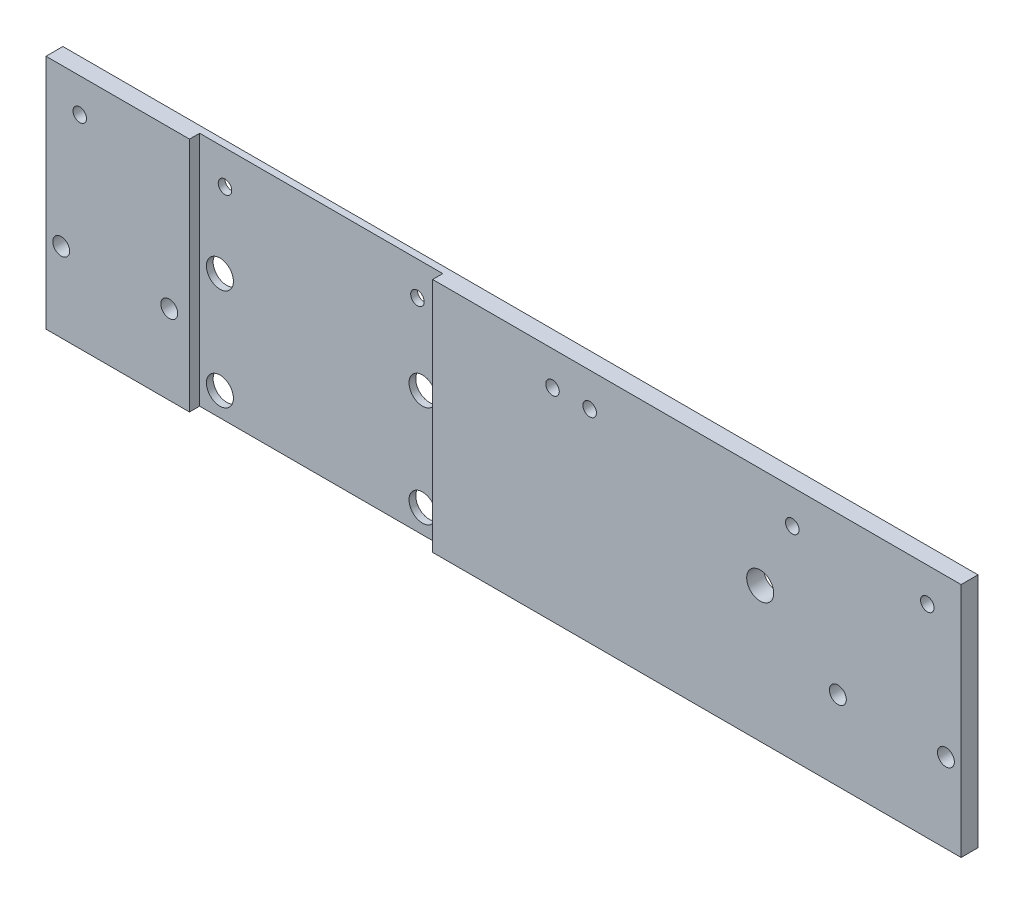
ISO-10303-21;
HEADER;
FILE_DESCRIPTION(('STEP AP214'),'2;1');
FILE_NAME('part.step','',(''),(''),'','','');
FILE_SCHEMA(('AUTOMOTIVE_DESIGN { 1 0 10303 214 1 1 1 1 }'));
ENDSEC;
DATA;
#1=APPLICATION_CONTEXT('core data for automotive mechanical design processes');
#2=APPLICATION_PROTOCOL_DEFINITION('international standard','automotive_design',2000,#1);
#3=PRODUCT_CONTEXT('',#1,'mechanical');
#4=PRODUCT('Part','Part','',(#3));
#5=PRODUCT_RELATED_PRODUCT_CATEGORY('part','',(#4));
#6=PRODUCT_DEFINITION_FORMATION('','',#4);
#7=PRODUCT_DEFINITION_CONTEXT('part definition',#1,'design');
#8=PRODUCT_DEFINITION('design','',#6,#7);
#9=PRODUCT_DEFINITION_SHAPE('','',#8);
#10=(LENGTH_UNIT() NAMED_UNIT(*) SI_UNIT(.MILLI.,.METRE.));
#11=(NAMED_UNIT(*) PLANE_ANGLE_UNIT() SI_UNIT($,.RADIAN.));
#12=(NAMED_UNIT(*) SI_UNIT($,.STERADIAN.) SOLID_ANGLE_UNIT());
#13=UNCERTAINTY_MEASURE_WITH_UNIT(LENGTH_MEASURE(1.E-05),#10,'distance_accuracy_value','');
#14=(GEOMETRIC_REPRESENTATION_CONTEXT(3) GLOBAL_UNCERTAINTY_ASSIGNED_CONTEXT((#13)) GLOBAL_UNIT_ASSIGNED_CONTEXT((#10,
#11,#12)) REPRESENTATION_CONTEXT('',''));
#15=CARTESIAN_POINT('',(0.,0.,0.));
#16=DIRECTION('',(0.,0.,1.));
#17=DIRECTION('',(1.,0.,0.));
#18=AXIS2_PLACEMENT_3D('',#15,#16,#17);
#19=CARTESIAN_POINT('',(0.,0.,5.));
#20=DIRECTION('',(0.,0.,-1.));
#21=DIRECTION('',(-1.,0.,0.));
#22=AXIS2_PLACEMENT_3D('',#19,#20,#21);
#23=PLANE('',#22);
#24=CARTESIAN_POINT('',(10.,60.,5.));
#25=DIRECTION('',(0.,0.,-1.));
#26=DIRECTION('',(-1.,0.,0.));
#27=AXIS2_PLACEMENT_3D('',#24,#25,#26);
#28=CIRCLE('',#27,2.);
#29=CARTESIAN_POINT('',(8.00000000000001,60.,5.));
#30=VERTEX_POINT('',#29);
#31=EDGE_CURVE('E188',#30,#30,#28,.T.);
#32=ORIENTED_EDGE('',*,*,#31,.T.);
#33=EDGE_LOOP('',(#32));
#34=FACE_BOUND('',#33,.T.);
#35=CARTESIAN_POINT('',(4.5,23.5,5.));
#36=DIRECTION('',(0.,0.,-1.));
#37=DIRECTION('',(-1.,0.,0.));
#38=AXIS2_PLACEMENT_3D('',#35,#36,#37);
#39=CIRCLE('',#38,2.5);
#40=CARTESIAN_POINT('',(2.,23.5,5.));
#41=VERTEX_POINT('',#40);
#42=EDGE_CURVE('E205',#41,#41,#39,.T.);
#43=ORIENTED_EDGE('',*,*,#42,.T.);
#44=EDGE_LOOP('',(#43));
#45=FACE_BOUND('',#44,.T.);
#46=CARTESIAN_POINT('',(36.5,23.5,5.));
#47=DIRECTION('',(0.,0.,-1.));
#48=DIRECTION('',(-1.,0.,0.));
#49=AXIS2_PLACEMENT_3D('',#46,#47,#48);
#50=CIRCLE('',#49,2.5);
#51=CARTESIAN_POINT('',(34.,23.5,5.));
#52=VERTEX_POINT('',#51);
#53=EDGE_CURVE('E211',#52,#52,#50,.T.);
#54=ORIENTED_EDGE('',*,*,#53,.T.);
#55=EDGE_LOOP('',(#54));
#56=FACE_BOUND('',#55,.T.);
#57=DIRECTION('',(1.,0.,0.));
#58=VECTOR('',#57,1.);
#59=CARTESIAN_POINT('',(0.,0.,5.));
#60=LINE('',#59,#58);
#61=CARTESIAN_POINT('',(0.,0.,5.));
#62=VERTEX_POINT('',#61);
#63=CARTESIAN_POINT('',(42.5,0.,5.));
#64=VERTEX_POINT('',#63);
#65=EDGE_CURVE('E88',#62,#64,#60,.T.);
#66=ORIENTED_EDGE('',*,*,#65,.T.);
#67=DIRECTION('',(0.,-1.,0.));
#68=VECTOR('',#67,1.);
#69=CARTESIAN_POINT('',(42.5,70.,5.));
#70=LINE('',#69,#68);
#71=CARTESIAN_POINT('',(42.5,70.,5.));
#72=VERTEX_POINT('',#71);
#73=EDGE_CURVE('E114',#72,#64,#70,.T.);
#74=ORIENTED_EDGE('',*,*,#73,.F.);
#75=DIRECTION('',(-1.,0.,0.));
#76=VECTOR('',#75,1.);
#77=CARTESIAN_POINT('',(0.,70.,5.));
#78=LINE('',#77,#76);
#79=CARTESIAN_POINT('',(0.,70.,5.));
#80=VERTEX_POINT('',#79);
#81=EDGE_CURVE('E59',#72,#80,#78,.T.);
#82=ORIENTED_EDGE('',*,*,#81,.T.);
#83=DIRECTION('',(0.,-1.,0.));
#84=VECTOR('',#83,1.);
#85=CARTESIAN_POINT('',(0.,0.,5.));
#86=LINE('',#85,#84);
#87=EDGE_CURVE('E145',#80,#62,#86,.T.);
#88=ORIENTED_EDGE('',*,*,#87,.T.);
#89=EDGE_LOOP('',(#66,#74,#82,#88));
#90=FACE_BOUND('',#89,.T.);
#91=ADVANCED_FACE('F33',(#34,#45,#56,#90),#23,.F.);
#92=CARTESIAN_POINT('',(0.,0.,5.));
#93=DIRECTION('',(1.,0.,0.));
#94=DIRECTION('',(0.,0.,-1.));
#95=AXIS2_PLACEMENT_3D('',#92,#93,#94);
#96=PLANE('',#95);
#97=DIRECTION('',(0.,-1.,0.));
#98=VECTOR('',#97,1.);
#99=CARTESIAN_POINT('',(0.,0.,0.));
#100=LINE('',#99,#98);
#101=CARTESIAN_POINT('',(0.,70.,0.));
#102=VERTEX_POINT('',#101);
#103=CARTESIAN_POINT('',(0.,0.,0.));
#104=VERTEX_POINT('',#103);
#105=EDGE_CURVE('E140',#102,#104,#100,.T.);
#106=ORIENTED_EDGE('',*,*,#105,.T.);
#107=DIRECTION('',(0.,0.,-1.));
#108=VECTOR('',#107,1.);
#109=CARTESIAN_POINT('',(0.,0.,5.));
#110=LINE('',#109,#108);
#111=EDGE_CURVE('E11',#62,#104,#110,.T.);
#112=ORIENTED_EDGE('',*,*,#111,.F.);
#113=ORIENTED_EDGE('',*,*,#87,.F.);
#114=DIRECTION('',(0.,0.,-1.));
#115=VECTOR('',#114,1.);
#116=CARTESIAN_POINT('',(0.,70.,5.));
#117=LINE('',#116,#115);
#118=EDGE_CURVE('E154',#80,#102,#117,.T.);
#119=ORIENTED_EDGE('',*,*,#118,.T.);
#120=EDGE_LOOP('',(#106,#112,#113,#119));
#121=FACE_BOUND('',#120,.T.);
#122=ADVANCED_FACE('F35',(#121),#96,.F.);
#123=CARTESIAN_POINT('',(0.,0.,5.));
#124=DIRECTION('',(0.,1.,0.));
#125=DIRECTION('',(0.,0.,1.));
#126=AXIS2_PLACEMENT_3D('',#123,#124,#125);
#127=PLANE('',#126);
#128=DIRECTION('',(1.,0.,0.));
#129=VECTOR('',#128,1.);
#130=CARTESIAN_POINT('',(42.5,0.,2.));
#131=LINE('',#130,#129);
#132=CARTESIAN_POINT('',(42.5,0.,2.));
#133=VERTEX_POINT('',#132);
#134=CARTESIAN_POINT('',(114.5,0.,2.));
#135=VERTEX_POINT('',#134);
#136=EDGE_CURVE('E122',#133,#135,#131,.T.);
#137=ORIENTED_EDGE('',*,*,#136,.F.);
#138=DIRECTION('',(0.,0.,1.));
#139=VECTOR('',#138,1.);
#140=CARTESIAN_POINT('',(42.5,0.,2.));
#141=LINE('',#140,#139);
#142=EDGE_CURVE('E109',#133,#64,#141,.T.);
#143=ORIENTED_EDGE('',*,*,#142,.T.);
#144=ORIENTED_EDGE('',*,*,#65,.F.);
#145=ORIENTED_EDGE('',*,*,#111,.T.);
#146=DIRECTION('',(1.,0.,0.));
#147=VECTOR('',#146,1.);
#148=CARTESIAN_POINT('',(0.,0.,0.));
#149=LINE('',#148,#147);
#150=CARTESIAN_POINT('',(271.,0.,0.));
#151=VERTEX_POINT('',#150);
#152=EDGE_CURVE('E157',#104,#151,#149,.T.);
#153=ORIENTED_EDGE('',*,*,#152,.T.);
#154=DIRECTION('',(0.,0.,-1.));
#155=VECTOR('',#154,1.);
#156=CARTESIAN_POINT('',(271.,0.,5.));
#157=LINE('',#156,#155);
#158=CARTESIAN_POINT('',(271.,0.,5.));
#159=VERTEX_POINT('',#158);
#160=EDGE_CURVE('E42',#159,#151,#157,.T.);
#161=ORIENTED_EDGE('',*,*,#160,.F.);
#162=CARTESIAN_POINT('',(114.5,0.,5.));
#163=VERTEX_POINT('',#162);
#164=EDGE_CURVE('E147',#163,#159,#60,.T.);
#165=ORIENTED_EDGE('',*,*,#164,.F.);
#166=DIRECTION('',(0.,0.,1.));
#167=VECTOR('',#166,1.);
#168=CARTESIAN_POINT('',(114.5,0.,2.));
#169=LINE('',#168,#167);
#170=EDGE_CURVE('E50',#135,#163,#169,.T.);
#171=ORIENTED_EDGE('',*,*,#170,.F.);
#172=EDGE_LOOP('',(#137,#143,#144,#145,#153,#161,#165,#171));
#173=FACE_BOUND('',#172,.T.);
#174=ADVANCED_FACE('F127',(#173),#127,.F.);
#175=CARTESIAN_POINT('',(271.,0.,5.));
#176=DIRECTION('',(-1.,0.,0.));
#177=DIRECTION('',(0.,0.,1.));
#178=AXIS2_PLACEMENT_3D('',#175,#176,#177);
#179=PLANE('',#178);
#180=DIRECTION('',(0.,1.,0.));
#181=VECTOR('',#180,1.);
#182=CARTESIAN_POINT('',(271.,0.,0.));
#183=LINE('',#182,#181);
#184=CARTESIAN_POINT('',(271.,70.,0.));
#185=VERTEX_POINT('',#184);
#186=EDGE_CURVE('E159',#151,#185,#183,.T.);
#187=ORIENTED_EDGE('',*,*,#186,.T.);
#188=DIRECTION('',(0.,0.,-1.));
#189=VECTOR('',#188,1.);
#190=CARTESIAN_POINT('',(271.,70.,5.));
#191=LINE('',#190,#189);
#192=CARTESIAN_POINT('',(271.,70.,5.));
#193=VERTEX_POINT('',#192);
#194=EDGE_CURVE('E163',#193,#185,#191,.T.);
#195=ORIENTED_EDGE('',*,*,#194,.F.);
#196=DIRECTION('',(0.,1.,0.));
#197=VECTOR('',#196,1.);
#198=CARTESIAN_POINT('',(271.,0.,5.));
#199=LINE('',#198,#197);
#200=EDGE_CURVE('E149',#159,#193,#199,.T.);
#201=ORIENTED_EDGE('',*,*,#200,.F.);
#202=ORIENTED_EDGE('',*,*,#160,.T.);
#203=EDGE_LOOP('',(#187,#195,#201,#202));
#204=FACE_BOUND('',#203,.T.);
#205=ADVANCED_FACE('F261',(#204),#179,.F.);
#206=CARTESIAN_POINT('',(0.,70.,5.));
#207=DIRECTION('',(0.,-1.,0.));
#208=DIRECTION('',(0.,0.,-1.));
#209=AXIS2_PLACEMENT_3D('',#206,#207,#208);
#210=PLANE('',#209);
#211=ORIENTED_EDGE('',*,*,#81,.F.);
#212=DIRECTION('',(0.,0.,1.));
#213=VECTOR('',#212,1.);
#214=CARTESIAN_POINT('',(42.5,70.,2.));
#215=LINE('',#214,#213);
#216=CARTESIAN_POINT('',(42.5,70.,2.));
#217=VERTEX_POINT('',#216);
#218=EDGE_CURVE('E138',#217,#72,#215,.T.);
#219=ORIENTED_EDGE('',*,*,#218,.F.);
#220=DIRECTION('',(-1.,0.,0.));
#221=VECTOR('',#220,1.);
#222=CARTESIAN_POINT('',(42.5,70.,2.));
#223=LINE('',#222,#221);
#224=CARTESIAN_POINT('',(114.5,70.,2.));
#225=VERTEX_POINT('',#224);
#226=EDGE_CURVE('E116',#225,#217,#223,.T.);
#227=ORIENTED_EDGE('',*,*,#226,.F.);
#228=DIRECTION('',(0.,0.,1.));
#229=VECTOR('',#228,1.);
#230=CARTESIAN_POINT('',(114.5,70.,2.));
#231=LINE('',#230,#229);
#232=CARTESIAN_POINT('',(114.5,70.,5.));
#233=VERTEX_POINT('',#232);
#234=EDGE_CURVE('E141',#225,#233,#231,.T.);
#235=ORIENTED_EDGE('',*,*,#234,.T.);
#236=EDGE_CURVE('E151',#193,#233,#78,.T.);
#237=ORIENTED_EDGE('',*,*,#236,.F.);
#238=ORIENTED_EDGE('',*,*,#194,.T.);
#239=DIRECTION('',(-1.,0.,0.));
#240=VECTOR('',#239,1.);
#241=CARTESIAN_POINT('',(0.,70.,0.));
#242=LINE('',#241,#240);
#243=EDGE_CURVE('E81',#185,#102,#242,.T.);
#244=ORIENTED_EDGE('',*,*,#243,.T.);
#245=ORIENTED_EDGE('',*,*,#118,.F.);
#246=EDGE_LOOP('',(#211,#219,#227,#235,#237,#238,#244,#245));
#247=FACE_BOUND('',#246,.T.);
#248=ADVANCED_FACE('F247',(#247),#210,.F.);
#249=CARTESIAN_POINT('',(150.,60.,5.));
#250=DIRECTION('',(0.,0.,-1.));
#251=DIRECTION('',(-1.,0.,0.));
#252=AXIS2_PLACEMENT_3D('',#249,#250,#251);
#253=CIRCLE('',#252,2.);
#254=CARTESIAN_POINT('',(148.,60.,5.));
#255=VERTEX_POINT('',#254);
#256=EDGE_CURVE('E266',#255,#255,#253,.T.);
#257=ORIENTED_EDGE('',*,*,#256,.T.);
#258=EDGE_LOOP('',(#257));
#259=FACE_BOUND('',#258,.T.);
#260=CARTESIAN_POINT('',(211.5,40.,5.));
#261=DIRECTION('',(0.,0.,-1.));
#262=DIRECTION('',(-1.,0.,0.));
#263=AXIS2_PLACEMENT_3D('',#260,#261,#262);
#264=CIRCLE('',#263,3.99999999999999);
#265=CARTESIAN_POINT('',(207.5,40.,5.));
#266=VERTEX_POINT('',#265);
#267=EDGE_CURVE('E270',#266,#266,#264,.T.);
#268=ORIENTED_EDGE('',*,*,#267,.T.);
#269=EDGE_LOOP('',(#268));
#270=FACE_BOUND('',#269,.T.);
#271=CARTESIAN_POINT('',(261.,60.,5.));
#272=DIRECTION('',(0.,0.,-1.));
#273=DIRECTION('',(-1.,0.,0.));
#274=AXIS2_PLACEMENT_3D('',#271,#272,#273);
#275=CIRCLE('',#274,2.);
#276=CARTESIAN_POINT('',(259.,60.,5.));
#277=VERTEX_POINT('',#276);
#278=EDGE_CURVE('E274',#277,#277,#275,.T.);
#279=ORIENTED_EDGE('',*,*,#278,.T.);
#280=EDGE_LOOP('',(#279));
#281=FACE_BOUND('',#280,.T.);
#282=CARTESIAN_POINT('',(221.,60.,5.));
#283=DIRECTION('',(0.,0.,-1.));
#284=DIRECTION('',(-1.,0.,0.));
#285=AXIS2_PLACEMENT_3D('',#282,#283,#284);
#286=CIRCLE('',#285,2.);
#287=CARTESIAN_POINT('',(219.,60.,5.));
#288=VERTEX_POINT('',#287);
#289=EDGE_CURVE('E278',#288,#288,#286,.T.);
#290=ORIENTED_EDGE('',*,*,#289,.T.);
#291=EDGE_LOOP('',(#290));
#292=FACE_BOUND('',#291,.T.);
#293=CARTESIAN_POINT('',(161.,60.,5.));
#294=DIRECTION('',(0.,0.,-1.));
#295=DIRECTION('',(-1.,0.,0.));
#296=AXIS2_PLACEMENT_3D('',#293,#294,#295);
#297=CIRCLE('',#296,2.);
#298=CARTESIAN_POINT('',(159.,60.,5.));
#299=VERTEX_POINT('',#298);
#300=EDGE_CURVE('E191',#299,#299,#297,.T.);
#301=ORIENTED_EDGE('',*,*,#300,.T.);
#302=EDGE_LOOP('',(#301));
#303=FACE_BOUND('',#302,.T.);
#304=CARTESIAN_POINT('',(266.5,23.5,5.));
#305=DIRECTION('',(0.,0.,-1.));
#306=DIRECTION('',(-1.,0.,0.));
#307=AXIS2_PLACEMENT_3D('',#304,#305,#306);
#308=CIRCLE('',#307,2.50000000000002);
#309=CARTESIAN_POINT('',(264.,23.5,5.));
#310=VERTEX_POINT('',#309);
#311=EDGE_CURVE('E217',#310,#310,#308,.T.);
#312=ORIENTED_EDGE('',*,*,#311,.T.);
#313=EDGE_LOOP('',(#312));
#314=FACE_BOUND('',#313,.T.);
#315=CARTESIAN_POINT('',(234.5,23.5,5.));
#316=DIRECTION('',(0.,0.,-1.));
#317=DIRECTION('',(-1.,0.,0.));
#318=AXIS2_PLACEMENT_3D('',#315,#316,#317);
#319=CIRCLE('',#318,2.5);
#320=CARTESIAN_POINT('',(232.,23.5,5.));
#321=VERTEX_POINT('',#320);
#322=EDGE_CURVE('E223',#321,#321,#319,.T.);
#323=ORIENTED_EDGE('',*,*,#322,.T.);
#324=EDGE_LOOP('',(#323));
#325=FACE_BOUND('',#324,.T.);
#326=ORIENTED_EDGE('',*,*,#236,.T.);
#327=DIRECTION('',(0.,1.,0.));
#328=VECTOR('',#327,1.);
#329=CARTESIAN_POINT('',(114.5,70.,5.));
#330=LINE('',#329,#328);
#331=EDGE_CURVE('E125',#163,#233,#330,.T.);
#332=ORIENTED_EDGE('',*,*,#331,.F.);
#333=ORIENTED_EDGE('',*,*,#164,.T.);
#334=ORIENTED_EDGE('',*,*,#200,.T.);
#335=EDGE_LOOP('',(#326,#332,#333,#334));
#336=FACE_BOUND('',#335,.T.);
#337=ADVANCED_FACE('F239',(#259,#270,#281,#292,#303,#314,#325,#336),#23,.F.);
#338=CARTESIAN_POINT('',(0.,0.,0.));
#339=DIRECTION('',(0.,0.,-1.));
#340=DIRECTION('',(-1.,0.,0.));
#341=AXIS2_PLACEMENT_3D('',#338,#339,#340);
#342=PLANE('',#341);
#343=CARTESIAN_POINT('',(150.,60.,0.));
#344=DIRECTION('',(0.,0.,-1.));
#345=DIRECTION('',(-1.,0.,0.));
#346=AXIS2_PLACEMENT_3D('',#343,#344,#345);
#347=CIRCLE('',#346,2.);
#348=CARTESIAN_POINT('',(148.,60.,0.));
#349=VERTEX_POINT('',#348);
#350=EDGE_CURVE('E364',#349,#349,#347,.T.);
#351=ORIENTED_EDGE('',*,*,#350,.F.);
#352=EDGE_LOOP('',(#351));
#353=FACE_BOUND('',#352,.T.);
#354=CARTESIAN_POINT('',(211.5,40.,0.));
#355=DIRECTION('',(0.,0.,-1.));
#356=DIRECTION('',(-1.,0.,0.));
#357=AXIS2_PLACEMENT_3D('',#354,#355,#356);
#358=CIRCLE('',#357,3.99999999999999);
#359=CARTESIAN_POINT('',(207.5,40.,0.));
#360=VERTEX_POINT('',#359);
#361=EDGE_CURVE('E365',#360,#360,#358,.T.);
#362=ORIENTED_EDGE('',*,*,#361,.F.);
#363=EDGE_LOOP('',(#362));
#364=FACE_BOUND('',#363,.T.);
#365=CARTESIAN_POINT('',(107.,60.,0.));
#366=DIRECTION('',(0.,0.,-1.));
#367=DIRECTION('',(-1.,0.,0.));
#368=AXIS2_PLACEMENT_3D('',#365,#366,#367);
#369=CIRCLE('',#368,2.);
#370=CARTESIAN_POINT('',(105.,60.,0.));
#371=VERTEX_POINT('',#370);
#372=EDGE_CURVE('E372',#371,#371,#369,.T.);
#373=ORIENTED_EDGE('',*,*,#372,.F.);
#374=EDGE_LOOP('',(#373));
#375=FACE_BOUND('',#374,.T.);
#376=CARTESIAN_POINT('',(261.,60.,0.));
#377=DIRECTION('',(0.,0.,-1.));
#378=DIRECTION('',(-1.,0.,0.));
#379=AXIS2_PLACEMENT_3D('',#376,#377,#378);
#380=CIRCLE('',#379,2.);
#381=CARTESIAN_POINT('',(259.,60.,0.));
#382=VERTEX_POINT('',#381);
#383=EDGE_CURVE('E375',#382,#382,#380,.T.);
#384=ORIENTED_EDGE('',*,*,#383,.F.);
#385=EDGE_LOOP('',(#384));
#386=FACE_BOUND('',#385,.T.);
#387=CARTESIAN_POINT('',(221.,60.,0.));
#388=DIRECTION('',(0.,0.,-1.));
#389=DIRECTION('',(-1.,0.,0.));
#390=AXIS2_PLACEMENT_3D('',#387,#388,#389);
#391=CIRCLE('',#390,2.);
#392=CARTESIAN_POINT('',(219.,60.,0.));
#393=VERTEX_POINT('',#392);
#394=EDGE_CURVE('E379',#393,#393,#391,.T.);
#395=ORIENTED_EDGE('',*,*,#394,.F.);
#396=EDGE_LOOP('',(#395));
#397=FACE_BOUND('',#396,.T.);
#398=CARTESIAN_POINT('',(161.,60.,0.));
#399=DIRECTION('',(0.,0.,-1.));
#400=DIRECTION('',(-1.,0.,0.));
#401=AXIS2_PLACEMENT_3D('',#398,#399,#400);
#402=CIRCLE('',#401,2.);
#403=CARTESIAN_POINT('',(159.,60.,0.));
#404=VERTEX_POINT('',#403);
#405=EDGE_CURVE('E196',#404,#404,#402,.T.);
#406=ORIENTED_EDGE('',*,*,#405,.F.);
#407=EDGE_LOOP('',(#406));
#408=FACE_BOUND('',#407,.T.);
#409=CARTESIAN_POINT('',(50.,60.,0.));
#410=DIRECTION('',(0.,0.,-1.));
#411=DIRECTION('',(-1.,0.,0.));
#412=AXIS2_PLACEMENT_3D('',#409,#410,#411);
#413=CIRCLE('',#412,2.);
#414=CARTESIAN_POINT('',(48.,60.,0.));
#415=VERTEX_POINT('',#414);
#416=EDGE_CURVE('E184',#415,#415,#413,.T.);
#417=ORIENTED_EDGE('',*,*,#416,.F.);
#418=EDGE_LOOP('',(#417));
#419=FACE_BOUND('',#418,.T.);
#420=CARTESIAN_POINT('',(10.,60.,0.));
#421=DIRECTION('',(0.,0.,-1.));
#422=DIRECTION('',(-1.,0.,0.));
#423=AXIS2_PLACEMENT_3D('',#420,#421,#422);
#424=CIRCLE('',#423,2.);
#425=CARTESIAN_POINT('',(8.00000000000001,60.,0.));
#426=VERTEX_POINT('',#425);
#427=EDGE_CURVE('E183',#426,#426,#424,.T.);
#428=ORIENTED_EDGE('',*,*,#427,.F.);
#429=EDGE_LOOP('',(#428));
#430=FACE_BOUND('',#429,.T.);
#431=CARTESIAN_POINT('',(4.5,23.5,0.));
#432=DIRECTION('',(0.,0.,-1.));
#433=DIRECTION('',(-1.,0.,0.));
#434=AXIS2_PLACEMENT_3D('',#431,#432,#433);
#435=CIRCLE('',#434,2.5);
#436=CARTESIAN_POINT('',(2.,23.5,0.));
#437=VERTEX_POINT('',#436);
#438=EDGE_CURVE('E202',#437,#437,#435,.T.);
#439=ORIENTED_EDGE('',*,*,#438,.F.);
#440=EDGE_LOOP('',(#439));
#441=FACE_BOUND('',#440,.T.);
#442=CARTESIAN_POINT('',(36.5,23.5,0.));
#443=DIRECTION('',(0.,0.,-1.));
#444=DIRECTION('',(-1.,0.,0.));
#445=AXIS2_PLACEMENT_3D('',#442,#443,#444);
#446=CIRCLE('',#445,2.5);
#447=CARTESIAN_POINT('',(34.,23.5,0.));
#448=VERTEX_POINT('',#447);
#449=EDGE_CURVE('E208',#448,#448,#446,.T.);
#450=ORIENTED_EDGE('',*,*,#449,.F.);
#451=EDGE_LOOP('',(#450));
#452=FACE_BOUND('',#451,.T.);
#453=CARTESIAN_POINT('',(266.5,23.5,0.));
#454=DIRECTION('',(0.,0.,-1.));
#455=DIRECTION('',(-1.,0.,0.));
#456=AXIS2_PLACEMENT_3D('',#453,#454,#455);
#457=CIRCLE('',#456,2.50000000000002);
#458=CARTESIAN_POINT('',(264.,23.5,0.));
#459=VERTEX_POINT('',#458);
#460=EDGE_CURVE('E214',#459,#459,#457,.T.);
#461=ORIENTED_EDGE('',*,*,#460,.F.);
#462=EDGE_LOOP('',(#461));
#463=FACE_BOUND('',#462,.T.);
#464=CARTESIAN_POINT('',(234.5,23.5,0.));
#465=DIRECTION('',(0.,0.,-1.));
#466=DIRECTION('',(-1.,0.,0.));
#467=AXIS2_PLACEMENT_3D('',#464,#465,#466);
#468=CIRCLE('',#467,2.5);
#469=CARTESIAN_POINT('',(232.,23.5,0.));
#470=VERTEX_POINT('',#469);
#471=EDGE_CURVE('E220',#470,#470,#468,.T.);
#472=ORIENTED_EDGE('',*,*,#471,.F.);
#473=EDGE_LOOP('',(#472));
#474=FACE_BOUND('',#473,.T.);
#475=CARTESIAN_POINT('',(48.5,7.,0.));
#476=DIRECTION('',(0.,0.,-1.));
#477=DIRECTION('',(-1.,0.,0.));
#478=AXIS2_PLACEMENT_3D('',#475,#476,#477);
#479=CIRCLE('',#478,4.00000000000001);
#480=CARTESIAN_POINT('',(44.5,7.,0.));
#481=VERTEX_POINT('',#480);
#482=EDGE_CURVE('E180',#481,#481,#479,.T.);
#483=ORIENTED_EDGE('',*,*,#482,.F.);
#484=EDGE_LOOP('',(#483));
#485=FACE_BOUND('',#484,.T.);
#486=CARTESIAN_POINT('',(108.5,7.,0.));
#487=DIRECTION('',(0.,0.,-1.));
#488=DIRECTION('',(-1.,0.,0.));
#489=AXIS2_PLACEMENT_3D('',#486,#487,#488);
#490=CIRCLE('',#489,3.99999999999999);
#491=CARTESIAN_POINT('',(104.5,7.,0.));
#492=VERTEX_POINT('',#491);
#493=EDGE_CURVE('E177',#492,#492,#490,.T.);
#494=ORIENTED_EDGE('',*,*,#493,.F.);
#495=EDGE_LOOP('',(#494));
#496=FACE_BOUND('',#495,.T.);
#497=CARTESIAN_POINT('',(108.5,37.,0.));
#498=DIRECTION('',(0.,0.,-1.));
#499=DIRECTION('',(-1.,0.,0.));
#500=AXIS2_PLACEMENT_3D('',#497,#498,#499);
#501=CIRCLE('',#500,3.99999999999999);
#502=CARTESIAN_POINT('',(104.5,37.,0.));
#503=VERTEX_POINT('',#502);
#504=EDGE_CURVE('E173',#503,#503,#501,.T.);
#505=ORIENTED_EDGE('',*,*,#504,.F.);
#506=EDGE_LOOP('',(#505));
#507=FACE_BOUND('',#506,.T.);
#508=CARTESIAN_POINT('',(48.5,37.,0.));
#509=DIRECTION('',(0.,0.,-1.));
#510=DIRECTION('',(-1.,0.,0.));
#511=AXIS2_PLACEMENT_3D('',#508,#509,#510);
#512=CIRCLE('',#511,4.00000000000001);
#513=CARTESIAN_POINT('',(44.5,37.,0.));
#514=VERTEX_POINT('',#513);
#515=EDGE_CURVE('E169',#514,#514,#512,.T.);
#516=ORIENTED_EDGE('',*,*,#515,.F.);
#517=EDGE_LOOP('',(#516));
#518=FACE_BOUND('',#517,.T.);
#519=ORIENTED_EDGE('',*,*,#105,.F.);
#520=ORIENTED_EDGE('',*,*,#243,.F.);
#521=ORIENTED_EDGE('',*,*,#186,.F.);
#522=ORIENTED_EDGE('',*,*,#152,.F.);
#523=EDGE_LOOP('',(#519,#520,#521,#522));
#524=FACE_BOUND('',#523,.T.);
#525=ADVANCED_FACE('F236',(#353,#364,#375,#386,#397,#408,#419,#430,#441,#452,#463,#474,#485,
#496,#507,#518,#524),#342,.T.);
#526=CARTESIAN_POINT('',(42.5,70.,2.));
#527=DIRECTION('',(-1.,0.,0.));
#528=DIRECTION('',(0.,-1.,0.));
#529=AXIS2_PLACEMENT_3D('',#526,#527,#528);
#530=PLANE('',#529);
#531=ORIENTED_EDGE('',*,*,#73,.T.);
#532=ORIENTED_EDGE('',*,*,#142,.F.);
#533=DIRECTION('',(0.,-1.,0.));
#534=VECTOR('',#533,1.);
#535=CARTESIAN_POINT('',(42.5,70.,2.));
#536=LINE('',#535,#534);
#537=EDGE_CURVE('E112',#217,#133,#536,.T.);
#538=ORIENTED_EDGE('',*,*,#537,.F.);
#539=ORIENTED_EDGE('',*,*,#218,.T.);
#540=EDGE_LOOP('',(#531,#532,#538,#539));
#541=FACE_BOUND('',#540,.T.);
#542=ADVANCED_FACE('F111',(#541),#530,.F.);
#543=CARTESIAN_POINT('',(114.5,70.,2.));
#544=DIRECTION('',(1.,0.,0.));
#545=DIRECTION('',(0.,1.,0.));
#546=AXIS2_PLACEMENT_3D('',#543,#544,#545);
#547=PLANE('',#546);
#548=ORIENTED_EDGE('',*,*,#331,.T.);
#549=ORIENTED_EDGE('',*,*,#234,.F.);
#550=DIRECTION('',(0.,1.,0.));
#551=VECTOR('',#550,1.);
#552=CARTESIAN_POINT('',(114.5,70.,2.));
#553=LINE('',#552,#551);
#554=EDGE_CURVE('E129',#135,#225,#553,.T.);
#555=ORIENTED_EDGE('',*,*,#554,.F.);
#556=ORIENTED_EDGE('',*,*,#170,.T.);
#557=EDGE_LOOP('',(#548,#549,#555,#556));
#558=FACE_BOUND('',#557,.T.);
#559=ADVANCED_FACE('F288',(#558),#547,.F.);
#560=CARTESIAN_POINT('',(0.,0.,2.));
#561=DIRECTION('',(0.,0.,1.));
#562=DIRECTION('',(1.,0.,0.));
#563=AXIS2_PLACEMENT_3D('',#560,#561,#562);
#564=PLANE('',#563);
#565=CARTESIAN_POINT('',(107.,60.,2.));
#566=DIRECTION('',(0.,0.,1.));
#567=DIRECTION('',(1.,0.,0.));
#568=AXIS2_PLACEMENT_3D('',#565,#566,#567);
#569=CIRCLE('',#568,2.);
#570=CARTESIAN_POINT('',(109.,60.,2.));
#571=VERTEX_POINT('',#570);
#572=EDGE_CURVE('E37',#571,#571,#569,.T.);
#573=ORIENTED_EDGE('',*,*,#572,.F.);
#574=EDGE_LOOP('',(#573));
#575=FACE_BOUND('',#574,.T.);
#576=CARTESIAN_POINT('',(50.,60.,2.));
#577=DIRECTION('',(0.,0.,1.));
#578=DIRECTION('',(1.,0.,0.));
#579=AXIS2_PLACEMENT_3D('',#576,#577,#578);
#580=CIRCLE('',#579,2.);
#581=CARTESIAN_POINT('',(52.,60.,2.));
#582=VERTEX_POINT('',#581);
#583=EDGE_CURVE('E181',#582,#582,#580,.T.);
#584=ORIENTED_EDGE('',*,*,#583,.F.);
#585=EDGE_LOOP('',(#584));
#586=FACE_BOUND('',#585,.T.);
#587=CARTESIAN_POINT('',(48.5,7.,2.));
#588=DIRECTION('',(0.,0.,1.));
#589=DIRECTION('',(1.,0.,0.));
#590=AXIS2_PLACEMENT_3D('',#587,#588,#589);
#591=CIRCLE('',#590,4.00000000000001);
#592=CARTESIAN_POINT('',(52.5,7.,2.));
#593=VERTEX_POINT('',#592);
#594=EDGE_CURVE('E178',#593,#593,#591,.T.);
#595=ORIENTED_EDGE('',*,*,#594,.F.);
#596=EDGE_LOOP('',(#595));
#597=FACE_BOUND('',#596,.T.);
#598=CARTESIAN_POINT('',(108.5,7.,2.));
#599=DIRECTION('',(0.,0.,1.));
#600=DIRECTION('',(1.,0.,0.));
#601=AXIS2_PLACEMENT_3D('',#598,#599,#600);
#602=CIRCLE('',#601,3.99999999999999);
#603=CARTESIAN_POINT('',(112.5,7.,2.));
#604=VERTEX_POINT('',#603);
#605=EDGE_CURVE('E174',#604,#604,#602,.T.);
#606=ORIENTED_EDGE('',*,*,#605,.F.);
#607=EDGE_LOOP('',(#606));
#608=FACE_BOUND('',#607,.T.);
#609=CARTESIAN_POINT('',(108.5,37.,2.));
#610=DIRECTION('',(0.,0.,1.));
#611=DIRECTION('',(1.,0.,0.));
#612=AXIS2_PLACEMENT_3D('',#609,#610,#611);
#613=CIRCLE('',#612,3.99999999999999);
#614=CARTESIAN_POINT('',(112.5,37.,2.));
#615=VERTEX_POINT('',#614);
#616=EDGE_CURVE('E170',#615,#615,#613,.T.);
#617=ORIENTED_EDGE('',*,*,#616,.F.);
#618=EDGE_LOOP('',(#617));
#619=FACE_BOUND('',#618,.T.);
#620=CARTESIAN_POINT('',(48.5,37.,2.));
#621=DIRECTION('',(0.,0.,1.));
#622=DIRECTION('',(1.,0.,0.));
#623=AXIS2_PLACEMENT_3D('',#620,#621,#622);
#624=CIRCLE('',#623,4.00000000000001);
#625=CARTESIAN_POINT('',(52.5,37.,2.));
#626=VERTEX_POINT('',#625);
#627=EDGE_CURVE('E136',#626,#626,#624,.T.);
#628=ORIENTED_EDGE('',*,*,#627,.F.);
#629=EDGE_LOOP('',(#628));
#630=FACE_BOUND('',#629,.T.);
#631=ORIENTED_EDGE('',*,*,#537,.T.);
#632=ORIENTED_EDGE('',*,*,#136,.T.);
#633=ORIENTED_EDGE('',*,*,#554,.T.);
#634=ORIENTED_EDGE('',*,*,#226,.T.);
#635=EDGE_LOOP('',(#631,#632,#633,#634));
#636=FACE_BOUND('',#635,.T.);
#637=ADVANCED_FACE('F120',(#575,#586,#597,#608,#619,#630,#636),#564,.T.);
#638=CARTESIAN_POINT('',(48.5,37.,10.));
#639=DIRECTION('',(0.,0.,-1.));
#640=DIRECTION('',(-1.,0.,0.));
#641=AXIS2_PLACEMENT_3D('',#638,#639,#640);
#642=CYLINDRICAL_SURFACE('',#641,4.00000000000001);
#643=ORIENTED_EDGE('',*,*,#627,.T.);
#644=EDGE_LOOP('',(#643));
#645=FACE_BOUND('',#644,.T.);
#646=ORIENTED_EDGE('',*,*,#515,.T.);
#647=EDGE_LOOP('',(#646));
#648=FACE_BOUND('',#647,.T.);
#649=ADVANCED_FACE('F234',(#645,#648),#642,.F.);
#650=CARTESIAN_POINT('',(108.5,37.,10.));
#651=DIRECTION('',(0.,0.,-1.));
#652=DIRECTION('',(-1.,0.,0.));
#653=AXIS2_PLACEMENT_3D('',#650,#651,#652);
#654=CYLINDRICAL_SURFACE('',#653,3.99999999999999);
#655=ORIENTED_EDGE('',*,*,#616,.T.);
#656=EDGE_LOOP('',(#655));
#657=FACE_BOUND('',#656,.T.);
#658=ORIENTED_EDGE('',*,*,#504,.T.);
#659=EDGE_LOOP('',(#658));
#660=FACE_BOUND('',#659,.T.);
#661=ADVANCED_FACE('F300',(#657,#660),#654,.F.);
#662=CARTESIAN_POINT('',(108.5,7.,10.));
#663=DIRECTION('',(0.,0.,-1.));
#664=DIRECTION('',(-1.,0.,0.));
#665=AXIS2_PLACEMENT_3D('',#662,#663,#664);
#666=CYLINDRICAL_SURFACE('',#665,3.99999999999999);
#667=ORIENTED_EDGE('',*,*,#605,.T.);
#668=EDGE_LOOP('',(#667));
#669=FACE_BOUND('',#668,.T.);
#670=ORIENTED_EDGE('',*,*,#493,.T.);
#671=EDGE_LOOP('',(#670));
#672=FACE_BOUND('',#671,.T.);
#673=ADVANCED_FACE('F304',(#669,#672),#666,.F.);
#674=CARTESIAN_POINT('',(48.5,7.,10.));
#675=DIRECTION('',(0.,0.,-1.));
#676=DIRECTION('',(-1.,0.,0.));
#677=AXIS2_PLACEMENT_3D('',#674,#675,#676);
#678=CYLINDRICAL_SURFACE('',#677,4.00000000000001);
#679=ORIENTED_EDGE('',*,*,#594,.T.);
#680=EDGE_LOOP('',(#679));
#681=FACE_BOUND('',#680,.T.);
#682=ORIENTED_EDGE('',*,*,#482,.T.);
#683=EDGE_LOOP('',(#682));
#684=FACE_BOUND('',#683,.T.);
#685=ADVANCED_FACE('F308',(#681,#684),#678,.F.);
#686=CARTESIAN_POINT('',(234.5,23.5,10.));
#687=DIRECTION('',(0.,0.,-1.));
#688=DIRECTION('',(-1.,0.,0.));
#689=AXIS2_PLACEMENT_3D('',#686,#687,#688);
#690=CYLINDRICAL_SURFACE('',#689,2.5);
#691=ORIENTED_EDGE('',*,*,#471,.T.);
#692=EDGE_LOOP('',(#691));
#693=FACE_BOUND('',#692,.T.);
#694=ORIENTED_EDGE('',*,*,#322,.F.);
#695=EDGE_LOOP('',(#694));
#696=FACE_BOUND('',#695,.T.);
#697=ADVANCED_FACE('F312',(#693,#696),#690,.F.);
#698=CARTESIAN_POINT('',(266.5,23.5,10.));
#699=DIRECTION('',(0.,0.,-1.));
#700=DIRECTION('',(-1.,0.,0.));
#701=AXIS2_PLACEMENT_3D('',#698,#699,#700);
#702=CYLINDRICAL_SURFACE('',#701,2.50000000000002);
#703=ORIENTED_EDGE('',*,*,#460,.T.);
#704=EDGE_LOOP('',(#703));
#705=FACE_BOUND('',#704,.T.);
#706=ORIENTED_EDGE('',*,*,#311,.F.);
#707=EDGE_LOOP('',(#706));
#708=FACE_BOUND('',#707,.T.);
#709=ADVANCED_FACE('F316',(#705,#708),#702,.F.);
#710=CARTESIAN_POINT('',(36.5,23.5,10.));
#711=DIRECTION('',(0.,0.,-1.));
#712=DIRECTION('',(-1.,0.,0.));
#713=AXIS2_PLACEMENT_3D('',#710,#711,#712);
#714=CYLINDRICAL_SURFACE('',#713,2.5);
#715=ORIENTED_EDGE('',*,*,#449,.T.);
#716=EDGE_LOOP('',(#715));
#717=FACE_BOUND('',#716,.T.);
#718=ORIENTED_EDGE('',*,*,#53,.F.);
#719=EDGE_LOOP('',(#718));
#720=FACE_BOUND('',#719,.T.);
#721=ADVANCED_FACE('F320',(#717,#720),#714,.F.);
#722=CARTESIAN_POINT('',(4.5,23.5,10.));
#723=DIRECTION('',(0.,0.,-1.));
#724=DIRECTION('',(-1.,0.,0.));
#725=AXIS2_PLACEMENT_3D('',#722,#723,#724);
#726=CYLINDRICAL_SURFACE('',#725,2.5);
#727=ORIENTED_EDGE('',*,*,#438,.T.);
#728=EDGE_LOOP('',(#727));
#729=FACE_BOUND('',#728,.T.);
#730=ORIENTED_EDGE('',*,*,#42,.F.);
#731=EDGE_LOOP('',(#730));
#732=FACE_BOUND('',#731,.T.);
#733=ADVANCED_FACE('F324',(#729,#732),#726,.F.);
#734=CARTESIAN_POINT('',(10.,60.,10.));
#735=DIRECTION('',(0.,0.,-1.));
#736=DIRECTION('',(-1.,0.,0.));
#737=AXIS2_PLACEMENT_3D('',#734,#735,#736);
#738=CYLINDRICAL_SURFACE('',#737,2.);
#739=ORIENTED_EDGE('',*,*,#427,.T.);
#740=EDGE_LOOP('',(#739));
#741=FACE_BOUND('',#740,.T.);
#742=ORIENTED_EDGE('',*,*,#31,.F.);
#743=EDGE_LOOP('',(#742));
#744=FACE_BOUND('',#743,.T.);
#745=ADVANCED_FACE('F328',(#741,#744),#738,.F.);
#746=CARTESIAN_POINT('',(50.,60.,10.));
#747=DIRECTION('',(0.,0.,-1.));
#748=DIRECTION('',(-1.,0.,0.));
#749=AXIS2_PLACEMENT_3D('',#746,#747,#748);
#750=CYLINDRICAL_SURFACE('',#749,2.);
#751=ORIENTED_EDGE('',*,*,#583,.T.);
#752=EDGE_LOOP('',(#751));
#753=FACE_BOUND('',#752,.T.);
#754=ORIENTED_EDGE('',*,*,#416,.T.);
#755=EDGE_LOOP('',(#754));
#756=FACE_BOUND('',#755,.T.);
#757=ADVANCED_FACE('F332',(#753,#756),#750,.F.);
#758=CARTESIAN_POINT('',(161.,60.,10.));
#759=DIRECTION('',(0.,0.,-1.));
#760=DIRECTION('',(-1.,0.,0.));
#761=AXIS2_PLACEMENT_3D('',#758,#759,#760);
#762=CYLINDRICAL_SURFACE('',#761,2.);
#763=ORIENTED_EDGE('',*,*,#405,.T.);
#764=EDGE_LOOP('',(#763));
#765=FACE_BOUND('',#764,.T.);
#766=ORIENTED_EDGE('',*,*,#300,.F.);
#767=EDGE_LOOP('',(#766));
#768=FACE_BOUND('',#767,.T.);
#769=ADVANCED_FACE('F336',(#765,#768),#762,.F.);
#770=CARTESIAN_POINT('',(221.,60.,10.));
#771=DIRECTION('',(0.,0.,-1.));
#772=DIRECTION('',(-1.,0.,0.));
#773=AXIS2_PLACEMENT_3D('',#770,#771,#772);
#774=CYLINDRICAL_SURFACE('',#773,2.);
#775=ORIENTED_EDGE('',*,*,#394,.T.);
#776=EDGE_LOOP('',(#775));
#777=FACE_BOUND('',#776,.T.);
#778=ORIENTED_EDGE('',*,*,#289,.F.);
#779=EDGE_LOOP('',(#778));
#780=FACE_BOUND('',#779,.T.);
#781=ADVANCED_FACE('F339',(#777,#780),#774,.F.);
#782=CARTESIAN_POINT('',(261.,60.,10.));
#783=DIRECTION('',(0.,0.,-1.));
#784=DIRECTION('',(-1.,0.,0.));
#785=AXIS2_PLACEMENT_3D('',#782,#783,#784);
#786=CYLINDRICAL_SURFACE('',#785,2.);
#787=ORIENTED_EDGE('',*,*,#383,.T.);
#788=EDGE_LOOP('',(#787));
#789=FACE_BOUND('',#788,.T.);
#790=ORIENTED_EDGE('',*,*,#278,.F.);
#791=EDGE_LOOP('',(#790));
#792=FACE_BOUND('',#791,.T.);
#793=ADVANCED_FACE('F343',(#789,#792),#786,.F.);
#794=CARTESIAN_POINT('',(107.,60.,10.));
#795=DIRECTION('',(0.,0.,-1.));
#796=DIRECTION('',(-1.,0.,0.));
#797=AXIS2_PLACEMENT_3D('',#794,#795,#796);
#798=CYLINDRICAL_SURFACE('',#797,2.);
#799=ORIENTED_EDGE('',*,*,#572,.T.);
#800=EDGE_LOOP('',(#799));
#801=FACE_BOUND('',#800,.T.);
#802=ORIENTED_EDGE('',*,*,#372,.T.);
#803=EDGE_LOOP('',(#802));
#804=FACE_BOUND('',#803,.T.);
#805=ADVANCED_FACE('F347',(#801,#804),#798,.F.);
#806=CARTESIAN_POINT('',(211.5,40.,10.));
#807=DIRECTION('',(0.,0.,-1.));
#808=DIRECTION('',(-1.,0.,0.));
#809=AXIS2_PLACEMENT_3D('',#806,#807,#808);
#810=CYLINDRICAL_SURFACE('',#809,3.99999999999999);
#811=ORIENTED_EDGE('',*,*,#361,.T.);
#812=EDGE_LOOP('',(#811));
#813=FACE_BOUND('',#812,.T.);
#814=ORIENTED_EDGE('',*,*,#267,.F.);
#815=EDGE_LOOP('',(#814));
#816=FACE_BOUND('',#815,.T.);
#817=ADVANCED_FACE('F351',(#813,#816),#810,.F.);
#818=CARTESIAN_POINT('',(150.,60.,10.));
#819=DIRECTION('',(0.,0.,-1.));
#820=DIRECTION('',(-1.,0.,0.));
#821=AXIS2_PLACEMENT_3D('',#818,#819,#820);
#822=CYLINDRICAL_SURFACE('',#821,2.);
#823=ORIENTED_EDGE('',*,*,#350,.T.);
#824=EDGE_LOOP('',(#823));
#825=FACE_BOUND('',#824,.T.);
#826=ORIENTED_EDGE('',*,*,#256,.F.);
#827=EDGE_LOOP('',(#826));
#828=FACE_BOUND('',#827,.T.);
#829=ADVANCED_FACE('F355',(#825,#828),#822,.F.);
#830=CLOSED_SHELL('',(#91,#122,#174,#205,#248,#337,#525,#542,#559,#637,#649,#661,#673,#685,#697,
#709,#721,#733,#745,#757,#769,#781,#793,#805,#817,#829));
#831=MANIFOLD_SOLID_BREP('B2',#830);
#832=ADVANCED_BREP_SHAPE_REPRESENTATION('',(#18,#831),#14);
#833=SHAPE_DEFINITION_REPRESENTATION(#9,#832);
ENDSEC;
END-ISO-10303-21;
